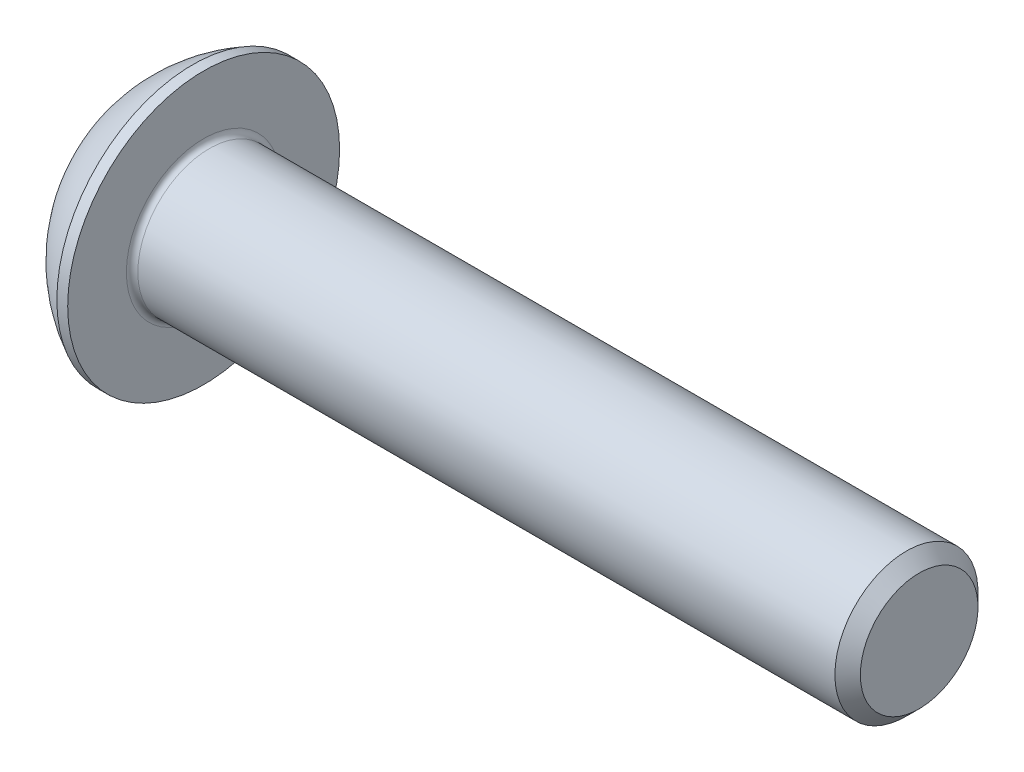
ISO-10303-21;
HEADER;
FILE_DESCRIPTION(('STEP AP214'),'2;1');
FILE_NAME('part.step','',(''),(''),'','','');
FILE_SCHEMA(('AUTOMOTIVE_DESIGN { 1 0 10303 214 1 1 1 1 }'));
ENDSEC;
DATA;
#1=APPLICATION_CONTEXT('core data for automotive mechanical design processes');
#2=APPLICATION_PROTOCOL_DEFINITION('international standard','automotive_design',2000,#1);
#3=PRODUCT_CONTEXT('',#1,'mechanical');
#4=PRODUCT('Part','Part','',(#3));
#5=PRODUCT_RELATED_PRODUCT_CATEGORY('part','',(#4));
#6=PRODUCT_DEFINITION_FORMATION('','',#4);
#7=PRODUCT_DEFINITION_CONTEXT('part definition',#1,'design');
#8=PRODUCT_DEFINITION('design','',#6,#7);
#9=PRODUCT_DEFINITION_SHAPE('','',#8);
#10=(LENGTH_UNIT() NAMED_UNIT(*) SI_UNIT(.MILLI.,.METRE.));
#11=(NAMED_UNIT(*) PLANE_ANGLE_UNIT() SI_UNIT($,.RADIAN.));
#12=(NAMED_UNIT(*) SI_UNIT($,.STERADIAN.) SOLID_ANGLE_UNIT());
#13=UNCERTAINTY_MEASURE_WITH_UNIT(LENGTH_MEASURE(1.E-05),#10,'distance_accuracy_value','');
#14=(GEOMETRIC_REPRESENTATION_CONTEXT(3) GLOBAL_UNCERTAINTY_ASSIGNED_CONTEXT((#13)) GLOBAL_UNIT_ASSIGNED_CONTEXT((#10,
#11,#12)) REPRESENTATION_CONTEXT('',''));
#15=CARTESIAN_POINT('',(0.,0.,0.));
#16=DIRECTION('',(0.,0.,1.));
#17=DIRECTION('',(1.,0.,0.));
#18=AXIS2_PLACEMENT_3D('',#15,#16,#17);
#19=CARTESIAN_POINT('',(0.,0.,0.));
#20=DIRECTION('',(-1.,0.,0.));
#21=DIRECTION('',(0.,0.,1.));
#22=AXIS2_PLACEMENT_3D('',#19,#20,#21);
#23=PLANE('',#22);
#24=CARTESIAN_POINT('',(0.,0.,0.));
#25=DIRECTION('',(-1.,0.,0.));
#26=DIRECTION('',(0.,0.,1.));
#27=AXIS2_PLACEMENT_3D('',#24,#25,#26);
#28=CIRCLE('',#27,2.375);
#29=CARTESIAN_POINT('',(0.,0.,2.375));
#30=VERTEX_POINT('',#29);
#31=EDGE_CURVE('E154',#30,#30,#28,.T.);
#32=ORIENTED_EDGE('',*,*,#31,.T.);
#33=EDGE_LOOP('',(#32));
#34=FACE_BOUND('',#33,.T.);
#35=DIRECTION('',(0.,-1.,0.));
#36=VECTOR('',#35,1.);
#37=CARTESIAN_POINT('',(0.,-0.866025403784438,1.5));
#38=LINE('',#37,#36);
#39=CARTESIAN_POINT('',(0.,0.866025403784439,1.5));
#40=VERTEX_POINT('',#39);
#41=CARTESIAN_POINT('',(0.,-0.866025403784438,1.5));
#42=VERTEX_POINT('',#41);
#43=EDGE_CURVE('E49',#40,#42,#38,.T.);
#44=ORIENTED_EDGE('',*,*,#43,.T.);
#45=DIRECTION('',(0.,-0.500000000000001,-0.866025403784438));
#46=VECTOR('',#45,1.);
#47=CARTESIAN_POINT('',(0.,-1.73205080756888,0.));
#48=LINE('',#47,#46);
#49=CARTESIAN_POINT('',(0.,-1.73205080756888,0.));
#50=VERTEX_POINT('',#49);
#51=EDGE_CURVE('E274',#42,#50,#48,.T.);
#52=ORIENTED_EDGE('',*,*,#51,.T.);
#53=DIRECTION('',(0.,0.500000000000001,-0.866025403784438));
#54=VECTOR('',#53,1.);
#55=CARTESIAN_POINT('',(0.,-0.866025403784438,-1.5));
#56=LINE('',#55,#54);
#57=CARTESIAN_POINT('',(0.,-0.866025403784438,-1.5));
#58=VERTEX_POINT('',#57);
#59=EDGE_CURVE('E129',#50,#58,#56,.T.);
#60=ORIENTED_EDGE('',*,*,#59,.T.);
#61=DIRECTION('',(0.,1.,0.));
#62=VECTOR('',#61,1.);
#63=CARTESIAN_POINT('',(0.,0.866025403784439,-1.5));
#64=LINE('',#63,#62);
#65=CARTESIAN_POINT('',(0.,0.866025403784439,-1.5));
#66=VERTEX_POINT('',#65);
#67=EDGE_CURVE('E277',#58,#66,#64,.T.);
#68=ORIENTED_EDGE('',*,*,#67,.T.);
#69=DIRECTION('',(0.,0.5,0.866025403784439));
#70=VECTOR('',#69,1.);
#71=CARTESIAN_POINT('',(0.,1.73205080756888,0.));
#72=LINE('',#71,#70);
#73=CARTESIAN_POINT('',(0.,1.73205080756888,0.));
#74=VERTEX_POINT('',#73);
#75=EDGE_CURVE('E279',#66,#74,#72,.T.);
#76=ORIENTED_EDGE('',*,*,#75,.T.);
#77=DIRECTION('',(0.,-0.5,0.866025403784439));
#78=VECTOR('',#77,1.);
#79=CARTESIAN_POINT('',(0.,0.866025403784439,1.5));
#80=LINE('',#79,#78);
#81=EDGE_CURVE('E281',#74,#40,#80,.T.);
#82=ORIENTED_EDGE('',*,*,#81,.T.);
#83=EDGE_LOOP('',(#44,#52,#60,#68,#76,#82));
#84=FACE_BOUND('',#83,.T.);
#85=ADVANCED_FACE('F34',(#34,#84),#23,.T.);
#86=CARTESIAN_POINT('',(4.75501582278481,0.,0.));
#87=DIRECTION('',(-1.,0.,0.));
#88=DIRECTION('',(0.,1.,0.));
#89=AXIS2_PLACEMENT_3D('',#86,#87,#88);
#90=SPHERICAL_SURFACE('',#89,5.3151482081814);
#91=CARTESIAN_POINT('',(2.37,0.,0.));
#92=DIRECTION('',(-1.,0.,0.));
#93=DIRECTION('',(0.,0.,1.));
#94=AXIS2_PLACEMENT_3D('',#91,#92,#93);
#95=CIRCLE('',#94,4.75);
#96=CARTESIAN_POINT('',(2.37,0.,4.75));
#97=VERTEX_POINT('',#96);
#98=EDGE_CURVE('E151',#97,#97,#95,.T.);
#99=ORIENTED_EDGE('',*,*,#98,.T.);
#100=EDGE_LOOP('',(#99));
#101=FACE_BOUND('',#100,.T.);
#102=ORIENTED_EDGE('',*,*,#31,.F.);
#103=EDGE_LOOP('',(#102));
#104=FACE_BOUND('',#103,.T.);
#105=ADVANCED_FACE('F175',(#101,#104),#90,.T.);
#106=CARTESIAN_POINT('',(0.,0.,0.));
#107=DIRECTION('',(-1.,0.,0.));
#108=DIRECTION('',(0.,0.,1.));
#109=AXIS2_PLACEMENT_3D('',#106,#107,#108);
#110=CYLINDRICAL_SURFACE('',#109,4.75);
#111=ORIENTED_EDGE('',*,*,#98,.F.);
#112=EDGE_LOOP('',(#111));
#113=FACE_BOUND('',#112,.T.);
#114=CARTESIAN_POINT('',(2.75,0.,0.));
#115=DIRECTION('',(-1.,0.,0.));
#116=DIRECTION('',(0.,0.,1.));
#117=AXIS2_PLACEMENT_3D('',#114,#115,#116);
#118=CIRCLE('',#117,4.75);
#119=CARTESIAN_POINT('',(2.75,0.,4.75));
#120=VERTEX_POINT('',#119);
#121=EDGE_CURVE('E148',#120,#120,#118,.T.);
#122=ORIENTED_EDGE('',*,*,#121,.T.);
#123=EDGE_LOOP('',(#122));
#124=FACE_BOUND('',#123,.T.);
#125=ADVANCED_FACE('F180',(#113,#124),#110,.T.);
#126=CARTESIAN_POINT('',(2.75,2.5,0.));
#127=DIRECTION('',(-1.,0.,0.));
#128=DIRECTION('',(0.,0.,1.));
#129=AXIS2_PLACEMENT_3D('',#126,#127,#128);
#130=PLANE('',#129);
#131=CARTESIAN_POINT('',(2.75,0.,0.));
#132=DIRECTION('',(-1.,0.,0.));
#133=DIRECTION('',(0.,0.,1.));
#134=AXIS2_PLACEMENT_3D('',#131,#132,#133);
#135=CIRCLE('',#134,2.7);
#136=CARTESIAN_POINT('',(2.75,0.,2.7));
#137=VERTEX_POINT('',#136);
#138=EDGE_CURVE('E42',#137,#137,#135,.T.);
#139=ORIENTED_EDGE('',*,*,#138,.T.);
#140=EDGE_LOOP('',(#139));
#141=FACE_BOUND('',#140,.T.);
#142=ORIENTED_EDGE('',*,*,#121,.F.);
#143=EDGE_LOOP('',(#142));
#144=FACE_BOUND('',#143,.T.);
#145=ADVANCED_FACE('F159',(#141,#144),#130,.F.);
#146=CARTESIAN_POINT('',(0.,0.,0.));
#147=DIRECTION('',(-1.,0.,0.));
#148=DIRECTION('',(0.,0.,1.));
#149=AXIS2_PLACEMENT_3D('',#146,#147,#148);
#150=CYLINDRICAL_SURFACE('',#149,2.5);
#151=CARTESIAN_POINT('',(2.95,0.,0.));
#152=DIRECTION('',(-1.,0.,0.));
#153=DIRECTION('',(0.,0.,1.));
#154=AXIS2_PLACEMENT_3D('',#151,#152,#153);
#155=CIRCLE('',#154,2.5);
#156=CARTESIAN_POINT('',(2.95,0.,2.5));
#157=VERTEX_POINT('',#156);
#158=EDGE_CURVE('E11',#157,#157,#155,.F.);
#159=ORIENTED_EDGE('',*,*,#158,.T.);
#160=EDGE_LOOP('',(#159));
#161=FACE_BOUND('',#160,.T.);
#162=CARTESIAN_POINT('',(27.305,0.,0.));
#163=DIRECTION('',(-1.,0.,0.));
#164=DIRECTION('',(0.,0.,1.));
#165=AXIS2_PLACEMENT_3D('',#162,#163,#164);
#166=CIRCLE('',#165,2.5);
#167=CARTESIAN_POINT('',(27.305,0.,2.5));
#168=VERTEX_POINT('',#167);
#169=EDGE_CURVE('E145',#168,#168,#166,.T.);
#170=ORIENTED_EDGE('',*,*,#169,.T.);
#171=EDGE_LOOP('',(#170));
#172=FACE_BOUND('',#171,.T.);
#173=ADVANCED_FACE('F189',(#161,#172),#150,.T.);
#174=CARTESIAN_POINT('',(27.75,0.,0.));
#175=DIRECTION('',(-1.,0.,0.));
#176=DIRECTION('',(0.,0.,1.));
#177=AXIS2_PLACEMENT_3D('',#174,#175,#176);
#178=CONICAL_SURFACE('',#177,2.055,0.785398163397439);
#179=ORIENTED_EDGE('',*,*,#169,.F.);
#180=EDGE_LOOP('',(#179));
#181=FACE_BOUND('',#180,.T.);
#182=CARTESIAN_POINT('',(27.75,0.,0.));
#183=DIRECTION('',(-1.,0.,0.));
#184=DIRECTION('',(0.,0.,1.));
#185=AXIS2_PLACEMENT_3D('',#182,#183,#184);
#186=CIRCLE('',#185,2.055);
#187=CARTESIAN_POINT('',(27.75,0.,2.055));
#188=VERTEX_POINT('',#187);
#189=EDGE_CURVE('E141',#188,#188,#186,.T.);
#190=ORIENTED_EDGE('',*,*,#189,.T.);
#191=EDGE_LOOP('',(#190));
#192=FACE_BOUND('',#191,.T.);
#193=ADVANCED_FACE('F170',(#181,#192),#178,.T.);
#194=CARTESIAN_POINT('',(27.75,0.,0.));
#195=DIRECTION('',(-1.,0.,0.));
#196=DIRECTION('',(0.,0.,1.));
#197=AXIS2_PLACEMENT_3D('',#194,#195,#196);
#198=PLANE('',#197);
#199=ORIENTED_EDGE('',*,*,#189,.F.);
#200=EDGE_LOOP('',(#199));
#201=FACE_BOUND('',#200,.T.);
#202=ADVANCED_FACE('F163',(#201),#198,.F.);
#203=CARTESIAN_POINT('',(2.95,0.,0.));
#204=DIRECTION('',(-1.,0.,0.));
#205=DIRECTION('',(0.,0.,1.));
#206=AXIS2_PLACEMENT_3D('',#203,#204,#205);
#207=TOROIDAL_SURFACE('',#206,2.7,0.2);
#208=ORIENTED_EDGE('',*,*,#158,.F.);
#209=EDGE_LOOP('',(#208));
#210=FACE_BOUND('',#209,.T.);
#211=ORIENTED_EDGE('',*,*,#138,.F.);
#212=EDGE_LOOP('',(#211));
#213=FACE_BOUND('',#212,.T.);
#214=ADVANCED_FACE('F36',(#210,#213),#207,.F.);
#215=CARTESIAN_POINT('',(1.56,-1.73205080756888,0.));
#216=DIRECTION('',(0.,0.866025403784438,-0.500000000000001));
#217=DIRECTION('',(0.,0.500000000000001,0.866025403784438));
#218=AXIS2_PLACEMENT_3D('',#215,#216,#217);
#219=PLANE('',#218);
#220=DIRECTION('',(0.,-0.500000000000001,-0.866025403784438));
#221=VECTOR('',#220,1.);
#222=CARTESIAN_POINT('',(1.56,-1.73205080756888,0.));
#223=LINE('',#222,#221);
#224=CARTESIAN_POINT('',(1.56,-0.866025403784438,1.5));
#225=VERTEX_POINT('',#224);
#226=CARTESIAN_POINT('',(1.56,-1.29903810567666,0.750000000000002));
#227=VERTEX_POINT('',#226);
#228=EDGE_CURVE('E115',#225,#227,#223,.T.);
#229=ORIENTED_EDGE('',*,*,#228,.T.);
#230=CARTESIAN_POINT('',(1.56,-1.73205080756888,0.));
#231=VERTEX_POINT('',#230);
#232=EDGE_CURVE('E110',#227,#231,#223,.T.);
#233=ORIENTED_EDGE('',*,*,#232,.T.);
#234=DIRECTION('',(-1.,0.,0.));
#235=VECTOR('',#234,1.);
#236=CARTESIAN_POINT('',(1.56,-1.73205080756888,0.));
#237=LINE('',#236,#235);
#238=EDGE_CURVE('E112',#231,#50,#237,.T.);
#239=ORIENTED_EDGE('',*,*,#238,.T.);
#240=ORIENTED_EDGE('',*,*,#51,.F.);
#241=DIRECTION('',(-1.,0.,0.));
#242=VECTOR('',#241,1.);
#243=CARTESIAN_POINT('',(1.56,-0.866025403784438,1.5));
#244=LINE('',#243,#242);
#245=EDGE_CURVE('E270',#225,#42,#244,.T.);
#246=ORIENTED_EDGE('',*,*,#245,.F.);
#247=EDGE_LOOP('',(#229,#233,#239,#240,#246));
#248=FACE_BOUND('',#247,.T.);
#249=ADVANCED_FACE('F111',(#248),#219,.T.);
#250=CARTESIAN_POINT('',(1.56,-0.866025403784438,-1.5));
#251=DIRECTION('',(0.,0.866025403784438,0.500000000000001));
#252=DIRECTION('',(0.,-0.500000000000001,0.866025403784438));
#253=AXIS2_PLACEMENT_3D('',#250,#251,#252);
#254=PLANE('',#253);
#255=DIRECTION('',(0.,0.500000000000001,-0.866025403784438));
#256=VECTOR('',#255,1.);
#257=CARTESIAN_POINT('',(1.56,-0.866025403784438,-1.5));
#258=LINE('',#257,#256);
#259=CARTESIAN_POINT('',(1.56,-1.29903810567666,-0.750000000000001));
#260=VERTEX_POINT('',#259);
#261=EDGE_CURVE('E57',#231,#260,#258,.T.);
#262=ORIENTED_EDGE('',*,*,#261,.T.);
#263=CARTESIAN_POINT('',(1.56,-0.866025403784438,-1.5));
#264=VERTEX_POINT('',#263);
#265=EDGE_CURVE('E124',#260,#264,#258,.T.);
#266=ORIENTED_EDGE('',*,*,#265,.T.);
#267=DIRECTION('',(-1.,0.,0.));
#268=VECTOR('',#267,1.);
#269=CARTESIAN_POINT('',(1.56,-0.866025403784438,-1.5));
#270=LINE('',#269,#268);
#271=EDGE_CURVE('E131',#264,#58,#270,.T.);
#272=ORIENTED_EDGE('',*,*,#271,.T.);
#273=ORIENTED_EDGE('',*,*,#59,.F.);
#274=ORIENTED_EDGE('',*,*,#238,.F.);
#275=EDGE_LOOP('',(#262,#266,#272,#273,#274));
#276=FACE_BOUND('',#275,.T.);
#277=ADVANCED_FACE('F127',(#276),#254,.T.);
#278=CARTESIAN_POINT('',(1.56,0.866025403784439,-1.5));
#279=DIRECTION('',(0.,0.,1.));
#280=DIRECTION('',(1.,0.,0.));
#281=AXIS2_PLACEMENT_3D('',#278,#279,#280);
#282=PLANE('',#281);
#283=DIRECTION('',(0.,1.,0.));
#284=VECTOR('',#283,1.);
#285=CARTESIAN_POINT('',(1.56,0.866025403784439,-1.5));
#286=LINE('',#285,#284);
#287=CARTESIAN_POINT('',(1.56,0.,-1.5));
#288=VERTEX_POINT('',#287);
#289=EDGE_CURVE('E251',#264,#288,#286,.T.);
#290=ORIENTED_EDGE('',*,*,#289,.T.);
#291=CARTESIAN_POINT('',(1.56,0.866025403784439,-1.5));
#292=VERTEX_POINT('',#291);
#293=EDGE_CURVE('E123',#288,#292,#286,.T.);
#294=ORIENTED_EDGE('',*,*,#293,.T.);
#295=DIRECTION('',(-1.,0.,0.));
#296=VECTOR('',#295,1.);
#297=CARTESIAN_POINT('',(1.56,0.866025403784439,-1.5));
#298=LINE('',#297,#296);
#299=EDGE_CURVE('E136',#292,#66,#298,.T.);
#300=ORIENTED_EDGE('',*,*,#299,.T.);
#301=ORIENTED_EDGE('',*,*,#67,.F.);
#302=ORIENTED_EDGE('',*,*,#271,.F.);
#303=EDGE_LOOP('',(#290,#294,#300,#301,#302));
#304=FACE_BOUND('',#303,.T.);
#305=ADVANCED_FACE('F203',(#304),#282,.T.);
#306=CARTESIAN_POINT('',(1.56,1.73205080756888,0.));
#307=DIRECTION('',(0.,-0.866025403784439,0.5));
#308=DIRECTION('',(0.,-0.5,-0.866025403784439));
#309=AXIS2_PLACEMENT_3D('',#306,#307,#308);
#310=PLANE('',#309);
#311=DIRECTION('',(0.,0.5,0.866025403784439));
#312=VECTOR('',#311,1.);
#313=CARTESIAN_POINT('',(1.56,1.73205080756888,0.));
#314=LINE('',#313,#312);
#315=CARTESIAN_POINT('',(1.56,1.29903810567666,-0.75));
#316=VERTEX_POINT('',#315);
#317=EDGE_CURVE('E240',#292,#316,#314,.T.);
#318=ORIENTED_EDGE('',*,*,#317,.T.);
#319=CARTESIAN_POINT('',(1.56,1.73205080756888,0.));
#320=VERTEX_POINT('',#319);
#321=EDGE_CURVE('E245',#316,#320,#314,.T.);
#322=ORIENTED_EDGE('',*,*,#321,.T.);
#323=DIRECTION('',(-1.,0.,0.));
#324=VECTOR('',#323,1.);
#325=CARTESIAN_POINT('',(1.56,1.73205080756888,0.));
#326=LINE('',#325,#324);
#327=EDGE_CURVE('E285',#320,#74,#326,.T.);
#328=ORIENTED_EDGE('',*,*,#327,.T.);
#329=ORIENTED_EDGE('',*,*,#75,.F.);
#330=ORIENTED_EDGE('',*,*,#299,.F.);
#331=EDGE_LOOP('',(#318,#322,#328,#329,#330));
#332=FACE_BOUND('',#331,.T.);
#333=ADVANCED_FACE('F206',(#332),#310,.T.);
#334=CARTESIAN_POINT('',(1.56,0.866025403784439,1.5));
#335=DIRECTION('',(0.,-0.866025403784439,-0.5));
#336=DIRECTION('',(0.,0.5,-0.866025403784439));
#337=AXIS2_PLACEMENT_3D('',#334,#335,#336);
#338=PLANE('',#337);
#339=DIRECTION('',(0.,-0.5,0.866025403784439));
#340=VECTOR('',#339,1.);
#341=CARTESIAN_POINT('',(1.56,0.866025403784439,1.5));
#342=LINE('',#341,#340);
#343=CARTESIAN_POINT('',(1.56,1.29903810567666,0.75));
#344=VERTEX_POINT('',#343);
#345=EDGE_CURVE('E248',#320,#344,#342,.T.);
#346=ORIENTED_EDGE('',*,*,#345,.T.);
#347=CARTESIAN_POINT('',(1.56,0.866025403784439,1.5));
#348=VERTEX_POINT('',#347);
#349=EDGE_CURVE('E256',#344,#348,#342,.T.);
#350=ORIENTED_EDGE('',*,*,#349,.T.);
#351=DIRECTION('',(-1.,0.,0.));
#352=VECTOR('',#351,1.);
#353=CARTESIAN_POINT('',(1.56,0.866025403784439,1.5));
#354=LINE('',#353,#352);
#355=EDGE_CURVE('E269',#348,#40,#354,.T.);
#356=ORIENTED_EDGE('',*,*,#355,.T.);
#357=ORIENTED_EDGE('',*,*,#81,.F.);
#358=ORIENTED_EDGE('',*,*,#327,.F.);
#359=EDGE_LOOP('',(#346,#350,#356,#357,#358));
#360=FACE_BOUND('',#359,.T.);
#361=ADVANCED_FACE('F210',(#360),#338,.T.);
#362=CARTESIAN_POINT('',(1.56,-0.866025403784438,1.5));
#363=DIRECTION('',(0.,0.,-1.));
#364=DIRECTION('',(-1.,0.,0.));
#365=AXIS2_PLACEMENT_3D('',#362,#363,#364);
#366=PLANE('',#365);
#367=DIRECTION('',(0.,-1.,0.));
#368=VECTOR('',#367,1.);
#369=CARTESIAN_POINT('',(1.56,-0.866025403784438,1.5));
#370=LINE('',#369,#368);
#371=CARTESIAN_POINT('',(1.56,0.,1.5));
#372=VERTEX_POINT('',#371);
#373=EDGE_CURVE('E262',#348,#372,#370,.T.);
#374=ORIENTED_EDGE('',*,*,#373,.T.);
#375=EDGE_CURVE('E264',#372,#225,#370,.T.);
#376=ORIENTED_EDGE('',*,*,#375,.T.);
#377=ORIENTED_EDGE('',*,*,#245,.T.);
#378=ORIENTED_EDGE('',*,*,#43,.F.);
#379=ORIENTED_EDGE('',*,*,#355,.F.);
#380=EDGE_LOOP('',(#374,#376,#377,#378,#379));
#381=FACE_BOUND('',#380,.T.);
#382=ADVANCED_FACE('F214',(#381),#366,.T.);
#383=CARTESIAN_POINT('',(1.56,-1.73205080756888,0.));
#384=DIRECTION('',(1.,0.,0.));
#385=DIRECTION('',(0.,0.,-1.));
#386=AXIS2_PLACEMENT_3D('',#383,#384,#385);
#387=PLANE('',#386);
#388=CARTESIAN_POINT('',(1.56,0.,0.));
#389=DIRECTION('',(-1.,0.,0.));
#390=DIRECTION('',(0.,0.,1.));
#391=AXIS2_PLACEMENT_3D('',#388,#389,#390);
#392=CIRCLE('',#391,1.5);
#393=EDGE_CURVE('E237',#316,#288,#392,.T.);
#394=ORIENTED_EDGE('',*,*,#393,.F.);
#395=ORIENTED_EDGE('',*,*,#317,.F.);
#396=ORIENTED_EDGE('',*,*,#293,.F.);
#397=EDGE_LOOP('',(#394,#395,#396));
#398=FACE_BOUND('',#397,.T.);
#399=ADVANCED_FACE('F218',(#398),#387,.F.);
#400=EDGE_CURVE('E142',#344,#316,#392,.T.);
#401=ORIENTED_EDGE('',*,*,#400,.F.);
#402=ORIENTED_EDGE('',*,*,#345,.F.);
#403=ORIENTED_EDGE('',*,*,#321,.F.);
#404=EDGE_LOOP('',(#401,#402,#403));
#405=FACE_BOUND('',#404,.T.);
#406=ADVANCED_FACE('F227',(#405),#387,.F.);
#407=EDGE_CURVE('E135',#372,#344,#392,.T.);
#408=ORIENTED_EDGE('',*,*,#407,.F.);
#409=ORIENTED_EDGE('',*,*,#373,.F.);
#410=ORIENTED_EDGE('',*,*,#349,.F.);
#411=EDGE_LOOP('',(#408,#409,#410));
#412=FACE_BOUND('',#411,.T.);
#413=ADVANCED_FACE('F232',(#412),#387,.F.);
#414=EDGE_CURVE('E130',#227,#372,#392,.T.);
#415=ORIENTED_EDGE('',*,*,#414,.F.);
#416=ORIENTED_EDGE('',*,*,#228,.F.);
#417=ORIENTED_EDGE('',*,*,#375,.F.);
#418=EDGE_LOOP('',(#415,#416,#417));
#419=FACE_BOUND('',#418,.T.);
#420=ADVANCED_FACE('F225',(#419),#387,.F.);
#421=EDGE_CURVE('E121',#260,#227,#392,.T.);
#422=ORIENTED_EDGE('',*,*,#421,.F.);
#423=ORIENTED_EDGE('',*,*,#261,.F.);
#424=ORIENTED_EDGE('',*,*,#232,.F.);
#425=EDGE_LOOP('',(#422,#423,#424));
#426=FACE_BOUND('',#425,.T.);
#427=ADVANCED_FACE('F120',(#426),#387,.F.);
#428=EDGE_CURVE('E243',#288,#260,#392,.T.);
#429=ORIENTED_EDGE('',*,*,#428,.F.);
#430=ORIENTED_EDGE('',*,*,#289,.F.);
#431=ORIENTED_EDGE('',*,*,#265,.F.);
#432=EDGE_LOOP('',(#429,#430,#431));
#433=FACE_BOUND('',#432,.T.);
#434=ADVANCED_FACE('F198',(#433),#387,.F.);
#435=CARTESIAN_POINT('',(2.42602540378445,0.,0.));
#436=DIRECTION('',(-1.,0.,0.));
#437=DIRECTION('',(0.,0.,1.));
#438=AXIS2_PLACEMENT_3D('',#435,#436,#437);
#439=CONICAL_SURFACE('',#438,0.,1.04719755119659);
#440=ORIENTED_EDGE('',*,*,#407,.T.);
#441=ORIENTED_EDGE('',*,*,#400,.T.);
#442=ORIENTED_EDGE('',*,*,#393,.T.);
#443=ORIENTED_EDGE('',*,*,#428,.T.);
#444=ORIENTED_EDGE('',*,*,#421,.T.);
#445=ORIENTED_EDGE('',*,*,#414,.T.);
#446=EDGE_LOOP('',(#440,#441,#442,#443,#444,#445));
#447=FACE_BOUND('',#446,.T.);
#448=CARTESIAN_POINT('',(2.42602540378445,0.,0.));
#449=VERTEX_POINT('',#448);
#450=VERTEX_LOOP('',#449);
#451=FACE_BOUND('',#450,.T.);
#452=ADVANCED_FACE('F196',(#447,#451),#439,.F.);
#453=CLOSED_SHELL('',(#85,#105,#125,#145,#173,#193,#202,#214,#249,#277,#305,#333,#361,#382,#399,
#406,#413,#420,#427,#434,#452));
#454=MANIFOLD_SOLID_BREP('B2',#453);
#455=ADVANCED_BREP_SHAPE_REPRESENTATION('',(#18,#454),#14);
#456=SHAPE_DEFINITION_REPRESENTATION(#9,#455);
ENDSEC;
END-ISO-10303-21;
